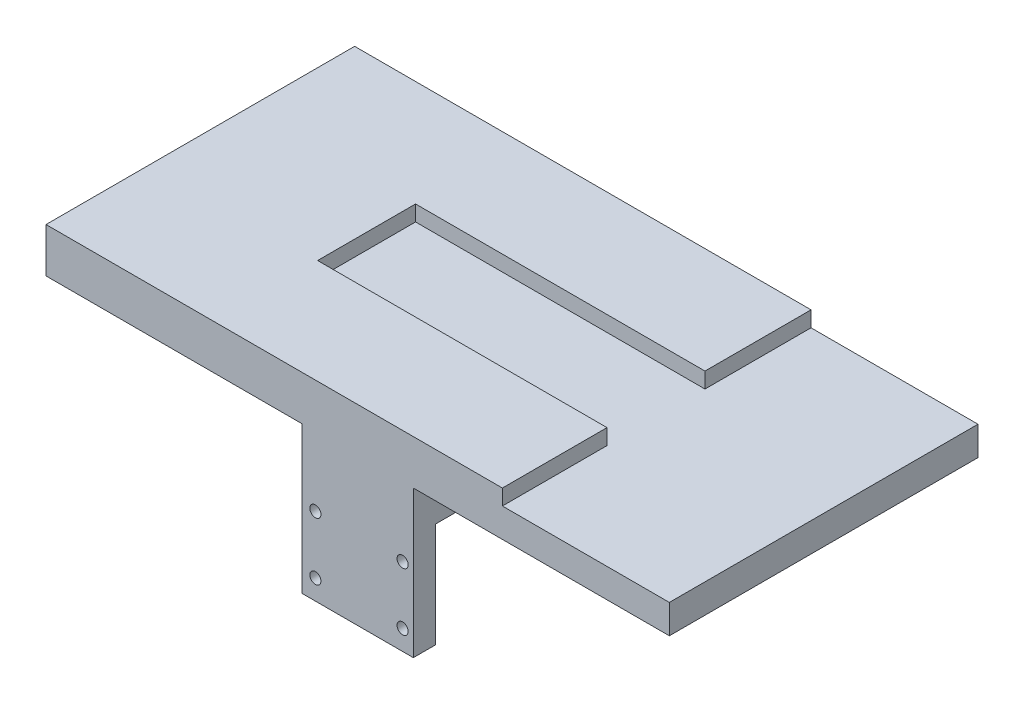
ISO-10303-21;
HEADER;
FILE_DESCRIPTION(('STEP AP214'),'2;1');
FILE_NAME('part.step','',(''),(''),'','','');
FILE_SCHEMA(('AUTOMOTIVE_DESIGN { 1 0 10303 214 1 1 1 1 }'));
ENDSEC;
DATA;
#1=APPLICATION_CONTEXT('core data for automotive mechanical design processes');
#2=APPLICATION_PROTOCOL_DEFINITION('international standard','automotive_design',2000,#1);
#3=PRODUCT_CONTEXT('',#1,'mechanical');
#4=PRODUCT('Part','Part','',(#3));
#5=PRODUCT_RELATED_PRODUCT_CATEGORY('part','',(#4));
#6=PRODUCT_DEFINITION_FORMATION('','',#4);
#7=PRODUCT_DEFINITION_CONTEXT('part definition',#1,'design');
#8=PRODUCT_DEFINITION('design','',#6,#7);
#9=PRODUCT_DEFINITION_SHAPE('','',#8);
#10=(LENGTH_UNIT() NAMED_UNIT(*) SI_UNIT(.MILLI.,.METRE.));
#11=(NAMED_UNIT(*) PLANE_ANGLE_UNIT() SI_UNIT($,.RADIAN.));
#12=(NAMED_UNIT(*) SI_UNIT($,.STERADIAN.) SOLID_ANGLE_UNIT());
#13=UNCERTAINTY_MEASURE_WITH_UNIT(LENGTH_MEASURE(1.E-05),#10,'distance_accuracy_value','');
#14=(GEOMETRIC_REPRESENTATION_CONTEXT(3) GLOBAL_UNCERTAINTY_ASSIGNED_CONTEXT((#13)) GLOBAL_UNIT_ASSIGNED_CONTEXT((#10,
#11,#12)) REPRESENTATION_CONTEXT('',''));
#15=CARTESIAN_POINT('',(0.,0.,0.));
#16=DIRECTION('',(0.,0.,1.));
#17=DIRECTION('',(1.,0.,0.));
#18=AXIS2_PLACEMENT_3D('',#15,#16,#17);
#19=CARTESIAN_POINT('',(0.,12.,0.));
#20=DIRECTION('',(1.,0.,0.));
#21=DIRECTION('',(0.,0.,-1.));
#22=AXIS2_PLACEMENT_3D('',#19,#20,#21);
#23=PLANE('',#22);
#24=DIRECTION('',(0.,1.,0.));
#25=VECTOR('',#24,1.);
#26=CARTESIAN_POINT('',(0.,-21.,-38.5));
#27=LINE('',#26,#25);
#28=CARTESIAN_POINT('',(0.,-21.,-38.5));
#29=VERTEX_POINT('',#28);
#30=CARTESIAN_POINT('',(0.,2.5,-38.5));
#31=VERTEX_POINT('',#30);
#32=EDGE_CURVE('E275',#29,#31,#27,.T.);
#33=ORIENTED_EDGE('',*,*,#32,.T.);
#34=DIRECTION('',(0.,0.,-1.));
#35=VECTOR('',#34,1.);
#36=CARTESIAN_POINT('',(0.,2.5,-38.5));
#37=LINE('',#36,#35);
#38=CARTESIAN_POINT('',(0.,2.5,0.5));
#39=VERTEX_POINT('',#38);
#40=EDGE_CURVE('E231',#39,#31,#37,.T.);
#41=ORIENTED_EDGE('',*,*,#40,.F.);
#42=DIRECTION('',(0.,1.,0.));
#43=VECTOR('',#42,1.);
#44=CARTESIAN_POINT('',(0.,-21.,0.5));
#45=LINE('',#44,#43);
#46=CARTESIAN_POINT('',(0.,-21.,0.5));
#47=VERTEX_POINT('',#46);
#48=EDGE_CURVE('E311',#47,#39,#45,.T.);
#49=ORIENTED_EDGE('',*,*,#48,.F.);
#50=DIRECTION('',(0.,0.,-1.));
#51=VECTOR('',#50,1.);
#52=CARTESIAN_POINT('',(0.,-21.,5.5));
#53=LINE('',#52,#51);
#54=CARTESIAN_POINT('',(0.,-21.,5.5));
#55=VERTEX_POINT('',#54);
#56=EDGE_CURVE('E297',#55,#47,#53,.T.);
#57=ORIENTED_EDGE('',*,*,#56,.F.);
#58=DIRECTION('',(0.,-1.,0.));
#59=VECTOR('',#58,1.);
#60=CARTESIAN_POINT('',(0.,12.,5.5));
#61=LINE('',#60,#59);
#62=CARTESIAN_POINT('',(0.,12.,5.5));
#63=VERTEX_POINT('',#62);
#64=EDGE_CURVE('E313',#63,#55,#61,.T.);
#65=ORIENTED_EDGE('',*,*,#64,.F.);
#66=DIRECTION('',(0.,0.,1.));
#67=VECTOR('',#66,1.);
#68=CARTESIAN_POINT('',(0.,12.,0.));
#69=LINE('',#68,#67);
#70=CARTESIAN_POINT('',(0.,12.,-43.5));
#71=VERTEX_POINT('',#70);
#72=EDGE_CURVE('E318',#71,#63,#69,.T.);
#73=ORIENTED_EDGE('',*,*,#72,.F.);
#74=DIRECTION('',(0.,-1.,0.));
#75=VECTOR('',#74,1.);
#76=CARTESIAN_POINT('',(0.,12.,-43.5));
#77=LINE('',#76,#75);
#78=CARTESIAN_POINT('',(0.,-21.,-43.5));
#79=VERTEX_POINT('',#78);
#80=EDGE_CURVE('E279',#71,#79,#77,.T.);
#81=ORIENTED_EDGE('',*,*,#80,.T.);
#82=DIRECTION('',(0.,0.,1.));
#83=VECTOR('',#82,1.);
#84=CARTESIAN_POINT('',(0.,-21.,-43.5));
#85=LINE('',#84,#83);
#86=EDGE_CURVE('E262',#79,#29,#85,.T.);
#87=ORIENTED_EDGE('',*,*,#86,.T.);
#88=EDGE_LOOP('',(#33,#41,#49,#57,#65,#73,#81,#87));
#89=FACE_BOUND('',#88,.T.);
#90=ADVANCED_FACE('F33',(#89),#23,.F.);
#91=CARTESIAN_POINT('',(25.,12.,0.));
#92=DIRECTION('',(-1.,0.,0.));
#93=DIRECTION('',(0.,0.,1.));
#94=AXIS2_PLACEMENT_3D('',#91,#92,#93);
#95=PLANE('',#94);
#96=DIRECTION('',(0.,0.,1.));
#97=VECTOR('',#96,1.);
#98=CARTESIAN_POINT('',(25.,2.5,0.5));
#99=LINE('',#98,#97);
#100=CARTESIAN_POINT('',(25.,2.5,-38.5));
#101=VERTEX_POINT('',#100);
#102=CARTESIAN_POINT('',(25.,2.5,0.5));
#103=VERTEX_POINT('',#102);
#104=EDGE_CURVE('E222',#101,#103,#99,.T.);
#105=ORIENTED_EDGE('',*,*,#104,.F.);
#106=DIRECTION('',(0.,1.,0.));
#107=VECTOR('',#106,1.);
#108=CARTESIAN_POINT('',(25.,-21.,-38.5));
#109=LINE('',#108,#107);
#110=CARTESIAN_POINT('',(25.,-21.,-38.5));
#111=VERTEX_POINT('',#110);
#112=EDGE_CURVE('E277',#111,#101,#109,.T.);
#113=ORIENTED_EDGE('',*,*,#112,.F.);
#114=DIRECTION('',(0.,0.,-1.));
#115=VECTOR('',#114,1.);
#116=CARTESIAN_POINT('',(25.,-21.,-43.5));
#117=LINE('',#116,#115);
#118=CARTESIAN_POINT('',(25.,-21.,-43.5));
#119=VERTEX_POINT('',#118);
#120=EDGE_CURVE('E269',#111,#119,#117,.T.);
#121=ORIENTED_EDGE('',*,*,#120,.T.);
#122=DIRECTION('',(0.,1.,0.));
#123=VECTOR('',#122,1.);
#124=CARTESIAN_POINT('',(25.,12.,-43.5));
#125=LINE('',#124,#123);
#126=CARTESIAN_POINT('',(25.,12.,-43.5));
#127=VERTEX_POINT('',#126);
#128=EDGE_CURVE('E281',#119,#127,#125,.T.);
#129=ORIENTED_EDGE('',*,*,#128,.T.);
#130=DIRECTION('',(0.,0.,-1.));
#131=VECTOR('',#130,1.);
#132=CARTESIAN_POINT('',(25.,12.,0.));
#133=LINE('',#132,#131);
#134=CARTESIAN_POINT('',(25.,12.,5.5));
#135=VERTEX_POINT('',#134);
#136=EDGE_CURVE('E225',#135,#127,#133,.T.);
#137=ORIENTED_EDGE('',*,*,#136,.F.);
#138=DIRECTION('',(0.,1.,0.));
#139=VECTOR('',#138,1.);
#140=CARTESIAN_POINT('',(25.,12.,5.5));
#141=LINE('',#140,#139);
#142=CARTESIAN_POINT('',(25.,-21.,5.5));
#143=VERTEX_POINT('',#142);
#144=EDGE_CURVE('E315',#143,#135,#141,.T.);
#145=ORIENTED_EDGE('',*,*,#144,.F.);
#146=DIRECTION('',(0.,0.,1.));
#147=VECTOR('',#146,1.);
#148=CARTESIAN_POINT('',(25.,-21.,5.5));
#149=LINE('',#148,#147);
#150=CARTESIAN_POINT('',(25.,-21.,0.5));
#151=VERTEX_POINT('',#150);
#152=EDGE_CURVE('E303',#151,#143,#149,.T.);
#153=ORIENTED_EDGE('',*,*,#152,.F.);
#154=DIRECTION('',(0.,1.,0.));
#155=VECTOR('',#154,1.);
#156=CARTESIAN_POINT('',(25.,-21.,0.5));
#157=LINE('',#156,#155);
#158=EDGE_CURVE('E309',#151,#103,#157,.T.);
#159=ORIENTED_EDGE('',*,*,#158,.T.);
#160=EDGE_LOOP('',(#105,#113,#121,#129,#137,#145,#153,#159));
#161=FACE_BOUND('',#160,.T.);
#162=ADVANCED_FACE('F382',(#161),#95,.F.);
#163=CARTESIAN_POINT('',(0.,0.,5.5));
#164=DIRECTION('',(0.,0.,1.));
#165=DIRECTION('',(1.,0.,0.));
#166=AXIS2_PLACEMENT_3D('',#163,#164,#165);
#167=PLANE('',#166);
#168=DIRECTION('',(1.,0.,0.));
#169=VECTOR('',#168,1.);
#170=CARTESIAN_POINT('',(82.5,18.5,5.50000000000001));
#171=LINE('',#170,#169);
#172=CARTESIAN_POINT('',(45.,18.5,5.50000000000001));
#173=VERTEX_POINT('',#172);
#174=CARTESIAN_POINT('',(82.5,18.5,5.50000000000001));
#175=VERTEX_POINT('',#174);
#176=EDGE_CURVE('E184',#173,#175,#171,.T.);
#177=ORIENTED_EDGE('',*,*,#176,.F.);
#178=DIRECTION('',(0.,1.,0.));
#179=VECTOR('',#178,1.);
#180=CARTESIAN_POINT('',(45.,-60.3131486491943,5.50000000000001));
#181=LINE('',#180,#179);
#182=CARTESIAN_POINT('',(45.,22.,5.50000000000001));
#183=VERTEX_POINT('',#182);
#184=EDGE_CURVE('E163',#173,#183,#181,.T.);
#185=ORIENTED_EDGE('',*,*,#184,.T.);
#186=DIRECTION('',(1.,0.,0.));
#187=VECTOR('',#186,1.);
#188=CARTESIAN_POINT('',(-25.,22.,5.50000000000001));
#189=LINE('',#188,#187);
#190=CARTESIAN_POINT('',(-57.5,22.,5.50000000000001));
#191=VERTEX_POINT('',#190);
#192=EDGE_CURVE('E243',#191,#183,#189,.T.);
#193=ORIENTED_EDGE('',*,*,#192,.F.);
#194=DIRECTION('',(0.,1.,0.));
#195=VECTOR('',#194,1.);
#196=CARTESIAN_POINT('',(-57.5,22.,5.50000000000001));
#197=LINE('',#196,#195);
#198=CARTESIAN_POINT('',(-57.5,12.,5.50000000000001));
#199=VERTEX_POINT('',#198);
#200=EDGE_CURVE('E206',#199,#191,#197,.T.);
#201=ORIENTED_EDGE('',*,*,#200,.F.);
#202=DIRECTION('',(1.,0.,0.));
#203=VECTOR('',#202,1.);
#204=CARTESIAN_POINT('',(-25.,12.,5.50000000000001));
#205=LINE('',#204,#203);
#206=EDGE_CURVE('E247',#199,#63,#205,.T.);
#207=ORIENTED_EDGE('',*,*,#206,.T.);
#208=ORIENTED_EDGE('',*,*,#64,.T.);
#209=DIRECTION('',(-1.,0.,0.));
#210=VECTOR('',#209,1.);
#211=CARTESIAN_POINT('',(0.,-21.,5.5));
#212=LINE('',#211,#210);
#213=EDGE_CURVE('E306',#143,#55,#212,.T.);
#214=ORIENTED_EDGE('',*,*,#213,.F.);
#215=ORIENTED_EDGE('',*,*,#144,.T.);
#216=CARTESIAN_POINT('',(82.5,12.,5.50000000000001));
#217=VERTEX_POINT('',#216);
#218=EDGE_CURVE('E241',#135,#217,#205,.T.);
#219=ORIENTED_EDGE('',*,*,#218,.T.);
#220=DIRECTION('',(0.,-1.,0.));
#221=VECTOR('',#220,1.);
#222=CARTESIAN_POINT('',(82.5,22.,5.50000000000001));
#223=LINE('',#222,#221);
#224=EDGE_CURVE('E212',#175,#217,#223,.T.);
#225=ORIENTED_EDGE('',*,*,#224,.F.);
#226=EDGE_LOOP('',(#177,#185,#193,#201,#207,#208,#214,#215,#219,#225));
#227=FACE_BOUND('',#226,.T.);
#228=CARTESIAN_POINT('',(3.,-3.53,5.5));
#229=DIRECTION('',(0.,0.,1.));
#230=DIRECTION('',(1.,0.,0.));
#231=AXIS2_PLACEMENT_3D('',#228,#229,#230);
#232=CIRCLE('',#231,1.25);
#233=CARTESIAN_POINT('',(4.25,-3.53,5.5));
#234=VERTEX_POINT('',#233);
#235=EDGE_CURVE('E284',#234,#234,#232,.T.);
#236=ORIENTED_EDGE('',*,*,#235,.F.);
#237=EDGE_LOOP('',(#236));
#238=FACE_BOUND('',#237,.T.);
#239=CARTESIAN_POINT('',(22.59,-3.53,5.5));
#240=DIRECTION('',(0.,0.,1.));
#241=DIRECTION('',(1.,0.,0.));
#242=AXIS2_PLACEMENT_3D('',#239,#240,#241);
#243=CIRCLE('',#242,1.25);
#244=CARTESIAN_POINT('',(23.84,-3.53,5.5));
#245=VERTEX_POINT('',#244);
#246=EDGE_CURVE('E289',#245,#245,#243,.T.);
#247=ORIENTED_EDGE('',*,*,#246,.F.);
#248=EDGE_LOOP('',(#247));
#249=FACE_BOUND('',#248,.T.);
#250=CARTESIAN_POINT('',(22.59,-16.5,5.5));
#251=DIRECTION('',(0.,0.,1.));
#252=DIRECTION('',(1.,0.,0.));
#253=AXIS2_PLACEMENT_3D('',#250,#251,#252);
#254=CIRCLE('',#253,1.25);
#255=CARTESIAN_POINT('',(23.84,-16.5,5.5));
#256=VERTEX_POINT('',#255);
#257=EDGE_CURVE('E285',#256,#256,#254,.T.);
#258=ORIENTED_EDGE('',*,*,#257,.F.);
#259=EDGE_LOOP('',(#258));
#260=FACE_BOUND('',#259,.T.);
#261=CARTESIAN_POINT('',(3.,-16.5,5.5));
#262=DIRECTION('',(0.,0.,1.));
#263=DIRECTION('',(1.,0.,0.));
#264=AXIS2_PLACEMENT_3D('',#261,#262,#263);
#265=CIRCLE('',#264,1.25);
#266=CARTESIAN_POINT('',(4.25,-16.5,5.5));
#267=VERTEX_POINT('',#266);
#268=EDGE_CURVE('E288',#267,#267,#265,.T.);
#269=ORIENTED_EDGE('',*,*,#268,.F.);
#270=EDGE_LOOP('',(#269));
#271=FACE_BOUND('',#270,.T.);
#272=ADVANCED_FACE('F387',(#227,#238,#249,#260,#271),#167,.T.);
#273=CARTESIAN_POINT('',(0.,-21.,0.5));
#274=DIRECTION('',(0.,0.,1.));
#275=DIRECTION('',(1.,0.,0.));
#276=AXIS2_PLACEMENT_3D('',#273,#274,#275);
#277=PLANE('',#276);
#278=CARTESIAN_POINT('',(3.,-3.53,0.5));
#279=DIRECTION('',(0.,0.,1.));
#280=DIRECTION('',(1.,0.,0.));
#281=AXIS2_PLACEMENT_3D('',#278,#279,#280);
#282=CIRCLE('',#281,1.25);
#283=CARTESIAN_POINT('',(4.25,-3.53,0.5));
#284=VERTEX_POINT('',#283);
#285=EDGE_CURVE('E301',#284,#284,#282,.T.);
#286=ORIENTED_EDGE('',*,*,#285,.T.);
#287=EDGE_LOOP('',(#286));
#288=FACE_BOUND('',#287,.T.);
#289=CARTESIAN_POINT('',(22.59,-3.53,0.5));
#290=DIRECTION('',(0.,0.,1.));
#291=DIRECTION('',(1.,0.,0.));
#292=AXIS2_PLACEMENT_3D('',#289,#290,#291);
#293=CIRCLE('',#292,1.25);
#294=CARTESIAN_POINT('',(23.84,-3.53,0.5));
#295=VERTEX_POINT('',#294);
#296=EDGE_CURVE('E328',#295,#295,#293,.T.);
#297=ORIENTED_EDGE('',*,*,#296,.T.);
#298=EDGE_LOOP('',(#297));
#299=FACE_BOUND('',#298,.T.);
#300=CARTESIAN_POINT('',(22.59,-16.5,0.5));
#301=DIRECTION('',(0.,0.,1.));
#302=DIRECTION('',(1.,0.,0.));
#303=AXIS2_PLACEMENT_3D('',#300,#301,#302);
#304=CIRCLE('',#303,1.25);
#305=CARTESIAN_POINT('',(23.84,-16.5,0.5));
#306=VERTEX_POINT('',#305);
#307=EDGE_CURVE('E325',#306,#306,#304,.T.);
#308=ORIENTED_EDGE('',*,*,#307,.T.);
#309=EDGE_LOOP('',(#308));
#310=FACE_BOUND('',#309,.T.);
#311=CARTESIAN_POINT('',(3.,-16.5,0.5));
#312=DIRECTION('',(0.,0.,1.));
#313=DIRECTION('',(1.,0.,0.));
#314=AXIS2_PLACEMENT_3D('',#311,#312,#313);
#315=CIRCLE('',#314,1.25);
#316=CARTESIAN_POINT('',(4.25,-16.5,0.5));
#317=VERTEX_POINT('',#316);
#318=EDGE_CURVE('E296',#317,#317,#315,.T.);
#319=ORIENTED_EDGE('',*,*,#318,.T.);
#320=EDGE_LOOP('',(#319));
#321=FACE_BOUND('',#320,.T.);
#322=ORIENTED_EDGE('',*,*,#48,.T.);
#323=DIRECTION('',(-1.,0.,0.));
#324=VECTOR('',#323,1.);
#325=CARTESIAN_POINT('',(0.,2.5,0.5));
#326=LINE('',#325,#324);
#327=EDGE_CURVE('E228',#103,#39,#326,.T.);
#328=ORIENTED_EDGE('',*,*,#327,.F.);
#329=ORIENTED_EDGE('',*,*,#158,.F.);
#330=DIRECTION('',(1.,0.,0.));
#331=VECTOR('',#330,1.);
#332=CARTESIAN_POINT('',(0.,-21.,0.5));
#333=LINE('',#332,#331);
#334=EDGE_CURVE('E300',#47,#151,#333,.T.);
#335=ORIENTED_EDGE('',*,*,#334,.F.);
#336=EDGE_LOOP('',(#322,#328,#329,#335));
#337=FACE_BOUND('',#336,.T.);
#338=ADVANCED_FACE('F417',(#288,#299,#310,#321,#337),#277,.F.);
#339=CARTESIAN_POINT('',(0.,-21.,0.));
#340=DIRECTION('',(0.,-1.,0.));
#341=DIRECTION('',(0.,0.,-1.));
#342=AXIS2_PLACEMENT_3D('',#339,#340,#341);
#343=PLANE('',#342);
#344=ORIENTED_EDGE('',*,*,#56,.T.);
#345=ORIENTED_EDGE('',*,*,#334,.T.);
#346=ORIENTED_EDGE('',*,*,#152,.T.);
#347=ORIENTED_EDGE('',*,*,#213,.T.);
#348=EDGE_LOOP('',(#344,#345,#346,#347));
#349=FACE_BOUND('',#348,.T.);
#350=ADVANCED_FACE('F413',(#349),#343,.T.);
#351=CARTESIAN_POINT('',(3.,-16.5,-4.5));
#352=DIRECTION('',(0.,0.,1.));
#353=DIRECTION('',(1.,0.,0.));
#354=AXIS2_PLACEMENT_3D('',#351,#352,#353);
#355=CYLINDRICAL_SURFACE('',#354,1.25);
#356=ORIENTED_EDGE('',*,*,#268,.T.);
#357=EDGE_LOOP('',(#356));
#358=FACE_BOUND('',#357,.T.);
#359=ORIENTED_EDGE('',*,*,#318,.F.);
#360=EDGE_LOOP('',(#359));
#361=FACE_BOUND('',#360,.T.);
#362=ADVANCED_FACE('F487',(#358,#361),#355,.F.);
#363=CARTESIAN_POINT('',(22.59,-16.5,-4.5));
#364=DIRECTION('',(0.,0.,1.));
#365=DIRECTION('',(1.,0.,0.));
#366=AXIS2_PLACEMENT_3D('',#363,#364,#365);
#367=CYLINDRICAL_SURFACE('',#366,1.25);
#368=ORIENTED_EDGE('',*,*,#257,.T.);
#369=EDGE_LOOP('',(#368));
#370=FACE_BOUND('',#369,.T.);
#371=ORIENTED_EDGE('',*,*,#307,.F.);
#372=EDGE_LOOP('',(#371));
#373=FACE_BOUND('',#372,.T.);
#374=ADVANCED_FACE('F483',(#370,#373),#367,.F.);
#375=CARTESIAN_POINT('',(22.59,-3.53,-4.5));
#376=DIRECTION('',(0.,0.,1.));
#377=DIRECTION('',(1.,0.,0.));
#378=AXIS2_PLACEMENT_3D('',#375,#376,#377);
#379=CYLINDRICAL_SURFACE('',#378,1.25);
#380=ORIENTED_EDGE('',*,*,#246,.T.);
#381=EDGE_LOOP('',(#380));
#382=FACE_BOUND('',#381,.T.);
#383=ORIENTED_EDGE('',*,*,#296,.F.);
#384=EDGE_LOOP('',(#383));
#385=FACE_BOUND('',#384,.T.);
#386=ADVANCED_FACE('F486',(#382,#385),#379,.F.);
#387=CARTESIAN_POINT('',(3.,-3.53,-4.5));
#388=DIRECTION('',(0.,0.,1.));
#389=DIRECTION('',(1.,0.,0.));
#390=AXIS2_PLACEMENT_3D('',#387,#388,#389);
#391=CYLINDRICAL_SURFACE('',#390,1.25);
#392=ORIENTED_EDGE('',*,*,#235,.T.);
#393=EDGE_LOOP('',(#392));
#394=FACE_BOUND('',#393,.T.);
#395=ORIENTED_EDGE('',*,*,#285,.F.);
#396=EDGE_LOOP('',(#395));
#397=FACE_BOUND('',#396,.T.);
#398=ADVANCED_FACE('F357',(#394,#397),#391,.F.);
#399=CARTESIAN_POINT('',(0.,0.,-43.5));
#400=DIRECTION('',(0.,0.,-1.));
#401=DIRECTION('',(1.,0.,0.));
#402=AXIS2_PLACEMENT_3D('',#399,#400,#401);
#403=PLANE('',#402);
#404=DIRECTION('',(-1.,0.,0.));
#405=VECTOR('',#404,1.);
#406=CARTESIAN_POINT('',(50.,12.,-43.5));
#407=LINE('',#406,#405);
#408=EDGE_CURVE('E40',#127,#71,#407,.T.);
#409=ORIENTED_EDGE('',*,*,#408,.F.);
#410=ORIENTED_EDGE('',*,*,#128,.F.);
#411=DIRECTION('',(-1.,0.,0.));
#412=VECTOR('',#411,1.);
#413=CARTESIAN_POINT('',(0.,-21.,-43.5));
#414=LINE('',#413,#412);
#415=EDGE_CURVE('E265',#119,#79,#414,.T.);
#416=ORIENTED_EDGE('',*,*,#415,.T.);
#417=ORIENTED_EDGE('',*,*,#80,.F.);
#418=EDGE_LOOP('',(#409,#410,#416,#417));
#419=FACE_BOUND('',#418,.T.);
#420=CARTESIAN_POINT('',(3.,-3.53,-43.5));
#421=DIRECTION('',(0.,0.,1.));
#422=DIRECTION('',(1.,0.,0.));
#423=AXIS2_PLACEMENT_3D('',#420,#421,#422);
#424=CIRCLE('',#423,1.25);
#425=CARTESIAN_POINT('',(4.25,-3.53,-43.5));
#426=VERTEX_POINT('',#425);
#427=EDGE_CURVE('E246',#426,#426,#424,.T.);
#428=ORIENTED_EDGE('',*,*,#427,.T.);
#429=EDGE_LOOP('',(#428));
#430=FACE_BOUND('',#429,.T.);
#431=CARTESIAN_POINT('',(22.59,-3.53,-43.5));
#432=DIRECTION('',(0.,0.,1.));
#433=DIRECTION('',(1.,0.,0.));
#434=AXIS2_PLACEMENT_3D('',#431,#432,#433);
#435=CIRCLE('',#434,1.25);
#436=CARTESIAN_POINT('',(23.84,-3.53,-43.5));
#437=VERTEX_POINT('',#436);
#438=EDGE_CURVE('E254',#437,#437,#435,.T.);
#439=ORIENTED_EDGE('',*,*,#438,.T.);
#440=EDGE_LOOP('',(#439));
#441=FACE_BOUND('',#440,.T.);
#442=CARTESIAN_POINT('',(22.59,-16.5,-43.5));
#443=DIRECTION('',(0.,0.,1.));
#444=DIRECTION('',(1.,0.,0.));
#445=AXIS2_PLACEMENT_3D('',#442,#443,#444);
#446=CIRCLE('',#445,1.25);
#447=CARTESIAN_POINT('',(23.84,-16.5,-43.5));
#448=VERTEX_POINT('',#447);
#449=EDGE_CURVE('E250',#448,#448,#446,.T.);
#450=ORIENTED_EDGE('',*,*,#449,.T.);
#451=EDGE_LOOP('',(#450));
#452=FACE_BOUND('',#451,.T.);
#453=CARTESIAN_POINT('',(3.,-16.5,-43.5));
#454=DIRECTION('',(0.,0.,1.));
#455=DIRECTION('',(1.,0.,0.));
#456=AXIS2_PLACEMENT_3D('',#453,#454,#455);
#457=CIRCLE('',#456,1.25);
#458=CARTESIAN_POINT('',(4.25,-16.5,-43.5));
#459=VERTEX_POINT('',#458);
#460=EDGE_CURVE('E253',#459,#459,#457,.T.);
#461=ORIENTED_EDGE('',*,*,#460,.T.);
#462=EDGE_LOOP('',(#461));
#463=FACE_BOUND('',#462,.T.);
#464=ADVANCED_FACE('F354',(#419,#430,#441,#452,#463),#403,.T.);
#465=CARTESIAN_POINT('',(0.,-21.,-38.5));
#466=DIRECTION('',(0.,0.,1.));
#467=DIRECTION('',(1.,0.,0.));
#468=AXIS2_PLACEMENT_3D('',#465,#466,#467);
#469=PLANE('',#468);
#470=CARTESIAN_POINT('',(3.,-3.53,-38.5));
#471=DIRECTION('',(0.,0.,1.));
#472=DIRECTION('',(1.,0.,0.));
#473=AXIS2_PLACEMENT_3D('',#470,#471,#472);
#474=CIRCLE('',#473,1.25);
#475=CARTESIAN_POINT('',(4.25,-3.53,-38.5));
#476=VERTEX_POINT('',#475);
#477=EDGE_CURVE('E266',#476,#476,#474,.F.);
#478=ORIENTED_EDGE('',*,*,#477,.T.);
#479=EDGE_LOOP('',(#478));
#480=FACE_BOUND('',#479,.T.);
#481=CARTESIAN_POINT('',(22.59,-3.53,-38.5));
#482=DIRECTION('',(0.,0.,1.));
#483=DIRECTION('',(1.,0.,0.));
#484=AXIS2_PLACEMENT_3D('',#481,#482,#483);
#485=CIRCLE('',#484,1.25);
#486=CARTESIAN_POINT('',(23.84,-3.53,-38.5));
#487=VERTEX_POINT('',#486);
#488=EDGE_CURVE('E338',#487,#487,#485,.F.);
#489=ORIENTED_EDGE('',*,*,#488,.T.);
#490=EDGE_LOOP('',(#489));
#491=FACE_BOUND('',#490,.T.);
#492=CARTESIAN_POINT('',(22.59,-16.5,-38.5));
#493=DIRECTION('',(0.,0.,1.));
#494=DIRECTION('',(1.,0.,0.));
#495=AXIS2_PLACEMENT_3D('',#492,#493,#494);
#496=CIRCLE('',#495,1.25);
#497=CARTESIAN_POINT('',(23.84,-16.5,-38.5));
#498=VERTEX_POINT('',#497);
#499=EDGE_CURVE('E335',#498,#498,#496,.F.);
#500=ORIENTED_EDGE('',*,*,#499,.T.);
#501=EDGE_LOOP('',(#500));
#502=FACE_BOUND('',#501,.T.);
#503=CARTESIAN_POINT('',(3.,-16.5,-38.5));
#504=DIRECTION('',(0.,0.,1.));
#505=DIRECTION('',(1.,0.,0.));
#506=AXIS2_PLACEMENT_3D('',#503,#504,#505);
#507=CIRCLE('',#506,1.25);
#508=CARTESIAN_POINT('',(4.25,-16.5,-38.5));
#509=VERTEX_POINT('',#508);
#510=EDGE_CURVE('E261',#509,#509,#507,.F.);
#511=ORIENTED_EDGE('',*,*,#510,.T.);
#512=EDGE_LOOP('',(#511));
#513=FACE_BOUND('',#512,.T.);
#514=ORIENTED_EDGE('',*,*,#112,.T.);
#515=DIRECTION('',(1.,0.,0.));
#516=VECTOR('',#515,1.);
#517=CARTESIAN_POINT('',(0.,2.5,-38.5));
#518=LINE('',#517,#516);
#519=EDGE_CURVE('E234',#31,#101,#518,.T.);
#520=ORIENTED_EDGE('',*,*,#519,.F.);
#521=ORIENTED_EDGE('',*,*,#32,.F.);
#522=DIRECTION('',(1.,0.,0.));
#523=VECTOR('',#522,1.);
#524=CARTESIAN_POINT('',(0.,-21.,-38.5));
#525=LINE('',#524,#523);
#526=EDGE_CURVE('E272',#29,#111,#525,.T.);
#527=ORIENTED_EDGE('',*,*,#526,.T.);
#528=EDGE_LOOP('',(#514,#520,#521,#527));
#529=FACE_BOUND('',#528,.T.);
#530=ADVANCED_FACE('F343',(#480,#491,#502,#513,#529),#469,.T.);
#531=CARTESIAN_POINT('',(0.,-21.,-38.));
#532=DIRECTION('',(0.,-1.,0.));
#533=DIRECTION('',(0.,0.,1.));
#534=AXIS2_PLACEMENT_3D('',#531,#532,#533);
#535=PLANE('',#534);
#536=ORIENTED_EDGE('',*,*,#86,.F.);
#537=ORIENTED_EDGE('',*,*,#415,.F.);
#538=ORIENTED_EDGE('',*,*,#120,.F.);
#539=ORIENTED_EDGE('',*,*,#526,.F.);
#540=EDGE_LOOP('',(#536,#537,#538,#539));
#541=FACE_BOUND('',#540,.T.);
#542=ADVANCED_FACE('F369',(#541),#535,.T.);
#543=CARTESIAN_POINT('',(3.,-16.5,-33.5));
#544=DIRECTION('',(0.,0.,-1.));
#545=DIRECTION('',(-1.,0.,0.));
#546=AXIS2_PLACEMENT_3D('',#543,#544,#545);
#547=CYLINDRICAL_SURFACE('',#546,1.25);
#548=ORIENTED_EDGE('',*,*,#510,.F.);
#549=EDGE_LOOP('',(#548));
#550=FACE_BOUND('',#549,.T.);
#551=ORIENTED_EDGE('',*,*,#460,.F.);
#552=EDGE_LOOP('',(#551));
#553=FACE_BOUND('',#552,.T.);
#554=ADVANCED_FACE('F366',(#550,#553),#547,.F.);
#555=CARTESIAN_POINT('',(22.59,-16.5,-33.5));
#556=DIRECTION('',(0.,0.,-1.));
#557=DIRECTION('',(-1.,0.,0.));
#558=AXIS2_PLACEMENT_3D('',#555,#556,#557);
#559=CYLINDRICAL_SURFACE('',#558,1.25);
#560=ORIENTED_EDGE('',*,*,#499,.F.);
#561=EDGE_LOOP('',(#560));
#562=FACE_BOUND('',#561,.T.);
#563=ORIENTED_EDGE('',*,*,#449,.F.);
#564=EDGE_LOOP('',(#563));
#565=FACE_BOUND('',#564,.T.);
#566=ADVANCED_FACE('F368',(#562,#565),#559,.F.);
#567=CARTESIAN_POINT('',(22.59,-3.53,-33.5));
#568=DIRECTION('',(0.,0.,-1.));
#569=DIRECTION('',(-1.,0.,0.));
#570=AXIS2_PLACEMENT_3D('',#567,#568,#569);
#571=CYLINDRICAL_SURFACE('',#570,1.25);
#572=ORIENTED_EDGE('',*,*,#488,.F.);
#573=EDGE_LOOP('',(#572));
#574=FACE_BOUND('',#573,.T.);
#575=ORIENTED_EDGE('',*,*,#438,.F.);
#576=EDGE_LOOP('',(#575));
#577=FACE_BOUND('',#576,.T.);
#578=ADVANCED_FACE('F350',(#574,#577),#571,.F.);
#579=CARTESIAN_POINT('',(3.,-3.53,-33.5));
#580=DIRECTION('',(0.,0.,-1.));
#581=DIRECTION('',(-1.,0.,0.));
#582=AXIS2_PLACEMENT_3D('',#579,#580,#581);
#583=CYLINDRICAL_SURFACE('',#582,1.25);
#584=ORIENTED_EDGE('',*,*,#477,.F.);
#585=EDGE_LOOP('',(#584));
#586=FACE_BOUND('',#585,.T.);
#587=ORIENTED_EDGE('',*,*,#427,.F.);
#588=EDGE_LOOP('',(#587));
#589=FACE_BOUND('',#588,.T.);
#590=ADVANCED_FACE('F346',(#586,#589),#583,.F.);
#591=CARTESIAN_POINT('',(0.,12.,0.));
#592=DIRECTION('',(0.,-1.,0.));
#593=DIRECTION('',(0.,0.,-1.));
#594=AXIS2_PLACEMENT_3D('',#591,#592,#593);
#595=PLANE('',#594);
#596=ORIENTED_EDGE('',*,*,#206,.F.);
#597=DIRECTION('',(0.,0.,1.));
#598=VECTOR('',#597,1.);
#599=CARTESIAN_POINT('',(-57.5,12.,-63.82));
#600=LINE('',#599,#598);
#601=CARTESIAN_POINT('',(-57.5,12.,-63.82));
#602=VERTEX_POINT('',#601);
#603=EDGE_CURVE('E203',#602,#199,#600,.T.);
#604=ORIENTED_EDGE('',*,*,#603,.F.);
#605=DIRECTION('',(-1.,0.,0.));
#606=VECTOR('',#605,1.);
#607=CARTESIAN_POINT('',(50.,12.,-63.82));
#608=LINE('',#607,#606);
#609=CARTESIAN_POINT('',(82.5,12.,-63.82));
#610=VERTEX_POINT('',#609);
#611=EDGE_CURVE('E219',#610,#602,#608,.T.);
#612=ORIENTED_EDGE('',*,*,#611,.F.);
#613=DIRECTION('',(0.,0.,-1.));
#614=VECTOR('',#613,1.);
#615=CARTESIAN_POINT('',(82.5,12.,5.50000000000001));
#616=LINE('',#615,#614);
#617=EDGE_CURVE('E214',#217,#610,#616,.T.);
#618=ORIENTED_EDGE('',*,*,#617,.F.);
#619=ORIENTED_EDGE('',*,*,#218,.F.);
#620=ORIENTED_EDGE('',*,*,#136,.T.);
#621=ORIENTED_EDGE('',*,*,#408,.T.);
#622=ORIENTED_EDGE('',*,*,#72,.T.);
#623=EDGE_LOOP('',(#596,#604,#612,#618,#619,#620,#621,#622));
#624=FACE_BOUND('',#623,.T.);
#625=ADVANCED_FACE('F349',(#624),#595,.T.);
#626=CARTESIAN_POINT('',(0.,22.,0.));
#627=DIRECTION('',(0.,-1.,0.));
#628=DIRECTION('',(0.,0.,-1.));
#629=AXIS2_PLACEMENT_3D('',#626,#627,#628);
#630=PLANE('',#629);
#631=ORIENTED_EDGE('',*,*,#192,.T.);
#632=DIRECTION('',(0.,0.,1.));
#633=VECTOR('',#632,1.);
#634=CARTESIAN_POINT('',(45.,22.,-63.82));
#635=LINE('',#634,#633);
#636=CARTESIAN_POINT('',(45.,22.,-18.));
#637=VERTEX_POINT('',#636);
#638=EDGE_CURVE('E429',#637,#183,#635,.T.);
#639=ORIENTED_EDGE('',*,*,#638,.F.);
#640=DIRECTION('',(1.,0.,0.));
#641=VECTOR('',#640,1.);
#642=CARTESIAN_POINT('',(82.5,22.,-18.));
#643=LINE('',#642,#641);
#644=CARTESIAN_POINT('',(-20.,22.,-18.));
#645=VERTEX_POINT('',#644);
#646=EDGE_CURVE('E189',#645,#637,#643,.T.);
#647=ORIENTED_EDGE('',*,*,#646,.F.);
#648=DIRECTION('',(0.,0.,1.));
#649=VECTOR('',#648,1.);
#650=CARTESIAN_POINT('',(-20.,22.,-23.));
#651=LINE('',#650,#649);
#652=CARTESIAN_POINT('',(-20.,22.,-40.));
#653=VERTEX_POINT('',#652);
#654=EDGE_CURVE('E237',#653,#645,#651,.T.);
#655=ORIENTED_EDGE('',*,*,#654,.F.);
#656=DIRECTION('',(-1.,0.,0.));
#657=VECTOR('',#656,1.);
#658=CARTESIAN_POINT('',(-20.,22.,-40.));
#659=LINE('',#658,#657);
#660=CARTESIAN_POINT('',(45.,22.,-40.));
#661=VERTEX_POINT('',#660);
#662=EDGE_CURVE('E197',#661,#653,#659,.T.);
#663=ORIENTED_EDGE('',*,*,#662,.F.);
#664=CARTESIAN_POINT('',(45.,22.,-63.82));
#665=VERTEX_POINT('',#664);
#666=EDGE_CURVE('E47',#665,#661,#635,.T.);
#667=ORIENTED_EDGE('',*,*,#666,.F.);
#668=DIRECTION('',(1.,0.,0.));
#669=VECTOR('',#668,1.);
#670=CARTESIAN_POINT('',(50.,22.,-63.82));
#671=LINE('',#670,#669);
#672=CARTESIAN_POINT('',(-57.5,22.,-63.82));
#673=VERTEX_POINT('',#672);
#674=EDGE_CURVE('E178',#673,#665,#671,.T.);
#675=ORIENTED_EDGE('',*,*,#674,.F.);
#676=DIRECTION('',(0.,0.,-1.));
#677=VECTOR('',#676,1.);
#678=CARTESIAN_POINT('',(-57.5,22.,-63.82));
#679=LINE('',#678,#677);
#680=EDGE_CURVE('E209',#191,#673,#679,.T.);
#681=ORIENTED_EDGE('',*,*,#680,.F.);
#682=EDGE_LOOP('',(#631,#639,#647,#655,#663,#667,#675,#681));
#683=FACE_BOUND('',#682,.T.);
#684=ADVANCED_FACE('F425',(#683),#630,.F.);
#685=CARTESIAN_POINT('',(-20.,18.5,-23.));
#686=DIRECTION('',(-1.,0.,0.));
#687=DIRECTION('',(0.,0.,1.));
#688=AXIS2_PLACEMENT_3D('',#685,#686,#687);
#689=PLANE('',#688);
#690=ORIENTED_EDGE('',*,*,#654,.T.);
#691=DIRECTION('',(0.,1.,0.));
#692=VECTOR('',#691,1.);
#693=CARTESIAN_POINT('',(-20.,22.,-18.));
#694=LINE('',#693,#692);
#695=CARTESIAN_POINT('',(-20.,18.5,-18.));
#696=VERTEX_POINT('',#695);
#697=EDGE_CURVE('E186',#696,#645,#694,.T.);
#698=ORIENTED_EDGE('',*,*,#697,.F.);
#699=DIRECTION('',(0.,0.,1.));
#700=VECTOR('',#699,1.);
#701=CARTESIAN_POINT('',(-20.,18.5,-23.));
#702=LINE('',#701,#700);
#703=CARTESIAN_POINT('',(-20.,18.5,-40.));
#704=VERTEX_POINT('',#703);
#705=EDGE_CURVE('E238',#704,#696,#702,.T.);
#706=ORIENTED_EDGE('',*,*,#705,.F.);
#707=DIRECTION('',(0.,-1.,0.));
#708=VECTOR('',#707,1.);
#709=CARTESIAN_POINT('',(-20.,22.,-40.));
#710=LINE('',#709,#708);
#711=EDGE_CURVE('E192',#653,#704,#710,.T.);
#712=ORIENTED_EDGE('',*,*,#711,.F.);
#713=EDGE_LOOP('',(#690,#698,#706,#712));
#714=FACE_BOUND('',#713,.T.);
#715=ADVANCED_FACE('F438',(#714),#689,.F.);
#716=CARTESIAN_POINT('',(0.,18.5,0.));
#717=DIRECTION('',(0.,-1.,0.));
#718=DIRECTION('',(0.,0.,-1.));
#719=AXIS2_PLACEMENT_3D('',#716,#717,#718);
#720=PLANE('',#719);
#721=DIRECTION('',(-1.,0.,0.));
#722=VECTOR('',#721,1.);
#723=CARTESIAN_POINT('',(82.5,18.5,-18.));
#724=LINE('',#723,#722);
#725=CARTESIAN_POINT('',(45.,18.5,-18.));
#726=VERTEX_POINT('',#725);
#727=EDGE_CURVE('E183',#726,#696,#724,.T.);
#728=ORIENTED_EDGE('',*,*,#727,.F.);
#729=DIRECTION('',(0.,0.,1.));
#730=VECTOR('',#729,1.);
#731=CARTESIAN_POINT('',(45.,18.5,-63.82));
#732=LINE('',#731,#730);
#733=EDGE_CURVE('E54',#726,#173,#732,.T.);
#734=ORIENTED_EDGE('',*,*,#733,.T.);
#735=ORIENTED_EDGE('',*,*,#176,.T.);
#736=DIRECTION('',(0.,0.,1.));
#737=VECTOR('',#736,1.);
#738=CARTESIAN_POINT('',(82.5,18.5,-35.));
#739=LINE('',#738,#737);
#740=CARTESIAN_POINT('',(82.5,18.5,-63.82));
#741=VERTEX_POINT('',#740);
#742=EDGE_CURVE('E170',#741,#175,#739,.T.);
#743=ORIENTED_EDGE('',*,*,#742,.F.);
#744=DIRECTION('',(-1.,0.,0.));
#745=VECTOR('',#744,1.);
#746=CARTESIAN_POINT('',(82.5,18.5,-63.82));
#747=LINE('',#746,#745);
#748=CARTESIAN_POINT('',(45.,18.5,-63.82));
#749=VERTEX_POINT('',#748);
#750=EDGE_CURVE('E166',#741,#749,#747,.T.);
#751=ORIENTED_EDGE('',*,*,#750,.T.);
#752=CARTESIAN_POINT('',(45.,18.5,-40.));
#753=VERTEX_POINT('',#752);
#754=EDGE_CURVE('E154',#749,#753,#732,.T.);
#755=ORIENTED_EDGE('',*,*,#754,.T.);
#756=DIRECTION('',(1.,0.,0.));
#757=VECTOR('',#756,1.);
#758=CARTESIAN_POINT('',(-20.,18.5,-40.));
#759=LINE('',#758,#757);
#760=EDGE_CURVE('E195',#704,#753,#759,.T.);
#761=ORIENTED_EDGE('',*,*,#760,.F.);
#762=ORIENTED_EDGE('',*,*,#705,.T.);
#763=EDGE_LOOP('',(#728,#734,#735,#743,#751,#755,#761,#762));
#764=FACE_BOUND('',#763,.T.);
#765=ADVANCED_FACE('F168',(#764),#720,.F.);
#766=CARTESIAN_POINT('',(0.,2.5,0.));
#767=DIRECTION('',(0.,-1.,0.));
#768=DIRECTION('',(0.,0.,-1.));
#769=AXIS2_PLACEMENT_3D('',#766,#767,#768);
#770=PLANE('',#769);
#771=ORIENTED_EDGE('',*,*,#104,.T.);
#772=ORIENTED_EDGE('',*,*,#327,.T.);
#773=ORIENTED_EDGE('',*,*,#40,.T.);
#774=ORIENTED_EDGE('',*,*,#519,.T.);
#775=EDGE_LOOP('',(#771,#772,#773,#774));
#776=FACE_BOUND('',#775,.T.);
#777=ADVANCED_FACE('F396',(#776),#770,.T.);
#778=CARTESIAN_POINT('',(0.,0.,-63.82));
#779=DIRECTION('',(0.,0.,-1.));
#780=DIRECTION('',(-1.,0.,0.));
#781=AXIS2_PLACEMENT_3D('',#778,#779,#780);
#782=PLANE('',#781);
#783=ORIENTED_EDGE('',*,*,#750,.F.);
#784=DIRECTION('',(0.,1.,0.));
#785=VECTOR('',#784,1.);
#786=CARTESIAN_POINT('',(82.5,22.,-63.82));
#787=LINE('',#786,#785);
#788=EDGE_CURVE('E217',#610,#741,#787,.T.);
#789=ORIENTED_EDGE('',*,*,#788,.F.);
#790=ORIENTED_EDGE('',*,*,#611,.T.);
#791=DIRECTION('',(0.,-1.,0.));
#792=VECTOR('',#791,1.);
#793=CARTESIAN_POINT('',(-57.5,22.,-63.82));
#794=LINE('',#793,#792);
#795=EDGE_CURVE('E200',#673,#602,#794,.T.);
#796=ORIENTED_EDGE('',*,*,#795,.F.);
#797=ORIENTED_EDGE('',*,*,#674,.T.);
#798=DIRECTION('',(0.,1.,0.));
#799=VECTOR('',#798,1.);
#800=CARTESIAN_POINT('',(45.,-60.3131486491943,-63.82));
#801=LINE('',#800,#799);
#802=EDGE_CURVE('E158',#749,#665,#801,.T.);
#803=ORIENTED_EDGE('',*,*,#802,.F.);
#804=EDGE_LOOP('',(#783,#789,#790,#796,#797,#803));
#805=FACE_BOUND('',#804,.T.);
#806=ADVANCED_FACE('F176',(#805),#782,.T.);
#807=CARTESIAN_POINT('',(82.5,0.,0.));
#808=DIRECTION('',(1.,0.,0.));
#809=DIRECTION('',(0.,0.,-1.));
#810=AXIS2_PLACEMENT_3D('',#807,#808,#809);
#811=PLANE('',#810);
#812=ORIENTED_EDGE('',*,*,#742,.T.);
#813=ORIENTED_EDGE('',*,*,#224,.T.);
#814=ORIENTED_EDGE('',*,*,#617,.T.);
#815=ORIENTED_EDGE('',*,*,#788,.T.);
#816=EDGE_LOOP('',(#812,#813,#814,#815));
#817=FACE_BOUND('',#816,.T.);
#818=ADVANCED_FACE('F450',(#817),#811,.T.);
#819=CARTESIAN_POINT('',(-57.5,0.,0.));
#820=DIRECTION('',(-1.,0.,0.));
#821=DIRECTION('',(0.,0.,1.));
#822=AXIS2_PLACEMENT_3D('',#819,#820,#821);
#823=PLANE('',#822);
#824=ORIENTED_EDGE('',*,*,#795,.T.);
#825=ORIENTED_EDGE('',*,*,#603,.T.);
#826=ORIENTED_EDGE('',*,*,#200,.T.);
#827=ORIENTED_EDGE('',*,*,#680,.T.);
#828=EDGE_LOOP('',(#824,#825,#826,#827));
#829=FACE_BOUND('',#828,.T.);
#830=ADVANCED_FACE('F423',(#829),#823,.T.);
#831=CARTESIAN_POINT('',(0.,0.,-40.));
#832=DIRECTION('',(0.,0.,1.));
#833=DIRECTION('',(1.,0.,0.));
#834=AXIS2_PLACEMENT_3D('',#831,#832,#833);
#835=PLANE('',#834);
#836=DIRECTION('',(0.,-1.,0.));
#837=VECTOR('',#836,1.);
#838=CARTESIAN_POINT('',(45.,0.,-40.));
#839=LINE('',#838,#837);
#840=EDGE_CURVE('E159',#661,#753,#839,.T.);
#841=ORIENTED_EDGE('',*,*,#840,.F.);
#842=ORIENTED_EDGE('',*,*,#662,.T.);
#843=ORIENTED_EDGE('',*,*,#711,.T.);
#844=ORIENTED_EDGE('',*,*,#760,.T.);
#845=EDGE_LOOP('',(#841,#842,#843,#844));
#846=FACE_BOUND('',#845,.T.);
#847=ADVANCED_FACE('F441',(#846),#835,.T.);
#848=CARTESIAN_POINT('',(0.,0.,-18.));
#849=DIRECTION('',(0.,0.,-1.));
#850=DIRECTION('',(-1.,0.,0.));
#851=AXIS2_PLACEMENT_3D('',#848,#849,#850);
#852=PLANE('',#851);
#853=DIRECTION('',(0.,1.,0.));
#854=VECTOR('',#853,1.);
#855=CARTESIAN_POINT('',(45.,0.,-18.));
#856=LINE('',#855,#854);
#857=EDGE_CURVE('E11',#726,#637,#856,.T.);
#858=ORIENTED_EDGE('',*,*,#857,.F.);
#859=ORIENTED_EDGE('',*,*,#727,.T.);
#860=ORIENTED_EDGE('',*,*,#697,.T.);
#861=ORIENTED_EDGE('',*,*,#646,.T.);
#862=EDGE_LOOP('',(#858,#859,#860,#861));
#863=FACE_BOUND('',#862,.T.);
#864=ADVANCED_FACE('F435',(#863),#852,.T.);
#865=CARTESIAN_POINT('',(45.,-60.3131486491943,-63.82));
#866=DIRECTION('',(-1.,0.,0.));
#867=DIRECTION('',(0.,0.,1.));
#868=AXIS2_PLACEMENT_3D('',#865,#866,#867);
#869=PLANE('',#868);
#870=ORIENTED_EDGE('',*,*,#857,.T.);
#871=ORIENTED_EDGE('',*,*,#638,.T.);
#872=ORIENTED_EDGE('',*,*,#184,.F.);
#873=ORIENTED_EDGE('',*,*,#733,.F.);
#874=EDGE_LOOP('',(#870,#871,#872,#873));
#875=FACE_BOUND('',#874,.T.);
#876=ADVANCED_FACE('F432',(#875),#869,.F.);
#877=ORIENTED_EDGE('',*,*,#840,.T.);
#878=ORIENTED_EDGE('',*,*,#754,.F.);
#879=ORIENTED_EDGE('',*,*,#802,.T.);
#880=ORIENTED_EDGE('',*,*,#666,.T.);
#881=EDGE_LOOP('',(#877,#878,#879,#880));
#882=FACE_BOUND('',#881,.T.);
#883=ADVANCED_FACE('F156',(#882),#869,.F.);
#884=CLOSED_SHELL('',(#90,#162,#272,#338,#350,#362,#374,#386,#398,#464,#530,#542,#554,#566,#578,
#590,#625,#684,#715,#765,#777,#806,#818,#830,#847,#864,#876,#883));
#885=MANIFOLD_SOLID_BREP('B2',#884);
#886=ADVANCED_BREP_SHAPE_REPRESENTATION('',(#18,#885),#14);
#887=SHAPE_DEFINITION_REPRESENTATION(#9,#886);
ENDSEC;
END-ISO-10303-21;
